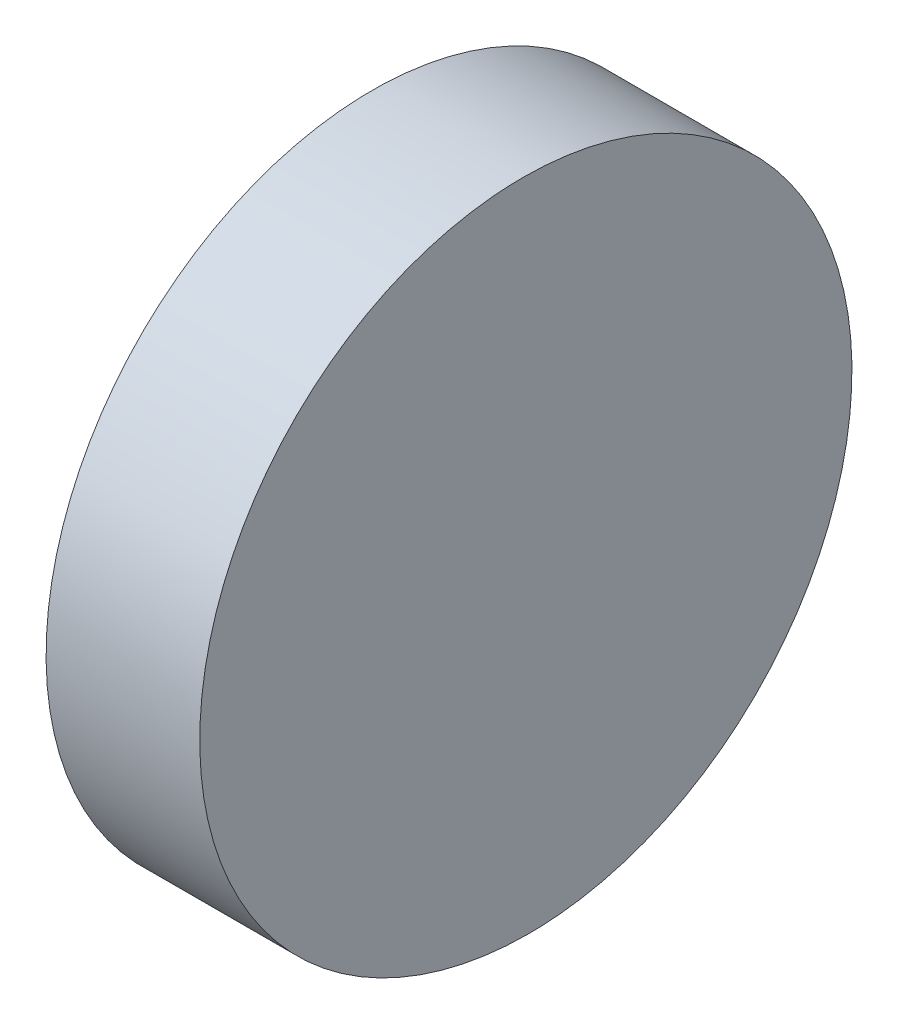
ISO-10303-21;
HEADER;
FILE_DESCRIPTION(('STEP AP214'),'2;1');
FILE_NAME('part.step','',(''),(''),'','','');
FILE_SCHEMA(('AUTOMOTIVE_DESIGN { 1 0 10303 214 1 1 1 1 }'));
ENDSEC;
DATA;
#1=APPLICATION_CONTEXT('core data for automotive mechanical design processes');
#2=APPLICATION_PROTOCOL_DEFINITION('international standard','automotive_design',2000,#1);
#3=PRODUCT_CONTEXT('',#1,'mechanical');
#4=PRODUCT('Part','Part','',(#3));
#5=PRODUCT_RELATED_PRODUCT_CATEGORY('part','',(#4));
#6=PRODUCT_DEFINITION_FORMATION('','',#4);
#7=PRODUCT_DEFINITION_CONTEXT('part definition',#1,'design');
#8=PRODUCT_DEFINITION('design','',#6,#7);
#9=PRODUCT_DEFINITION_SHAPE('','',#8);
#10=(LENGTH_UNIT() NAMED_UNIT(*) SI_UNIT(.MILLI.,.METRE.));
#11=(NAMED_UNIT(*) PLANE_ANGLE_UNIT() SI_UNIT($,.RADIAN.));
#12=(NAMED_UNIT(*) SI_UNIT($,.STERADIAN.) SOLID_ANGLE_UNIT());
#13=UNCERTAINTY_MEASURE_WITH_UNIT(LENGTH_MEASURE(1.E-05),#10,'distance_accuracy_value','');
#14=(GEOMETRIC_REPRESENTATION_CONTEXT(3) GLOBAL_UNCERTAINTY_ASSIGNED_CONTEXT((#13)) GLOBAL_UNIT_ASSIGNED_CONTEXT((#10,
#11,#12)) REPRESENTATION_CONTEXT('',''));
#15=CARTESIAN_POINT('',(0.,0.,0.));
#16=DIRECTION('',(0.,0.,1.));
#17=DIRECTION('',(1.,0.,0.));
#18=AXIS2_PLACEMENT_3D('',#15,#16,#17);
#19=CARTESIAN_POINT('',(0.,6.25,12.5));
#20=DIRECTION('',(1.,0.,0.));
#21=DIRECTION('',(0.,1.,0.));
#22=AXIS2_PLACEMENT_3D('',#19,#20,#21);
#23=PLANE('',#22);
#24=CARTESIAN_POINT('',(0.,0.,6.25));
#25=DIRECTION('',(-1.,0.,0.));
#26=DIRECTION('',(0.,-1.,0.));
#27=AXIS2_PLACEMENT_3D('',#24,#25,#26);
#28=CIRCLE('',#27,6.25);
#29=CARTESIAN_POINT('',(0.,-6.25,6.25));
#30=VERTEX_POINT('',#29);
#31=EDGE_CURVE('E76',#30,#30,#28,.T.);
#32=ORIENTED_EDGE('',*,*,#31,.T.);
#33=EDGE_LOOP('',(#32));
#34=FACE_BOUND('',#33,.T.);
#35=ADVANCED_FACE('F69',(#34),#23,.F.);
#36=CARTESIAN_POINT('',(3.,-6.25,12.5));
#37=DIRECTION('',(-0.999961923064171,-0.00872653549836698,0.));
#38=DIRECTION('',(0.00872653549836698,-0.999961923064171,0.));
#39=AXIS2_PLACEMENT_3D('',#36,#37,#38);
#40=PLANE('',#39);
#41=CARTESIAN_POINT('',(2.9454570763078,0.,6.25));
#42=DIRECTION('',(-0.999961923064171,-0.00872653549836698,0.));
#43=DIRECTION('',(-0.00872653549836698,0.999961923064171,0.));
#44=AXIS2_PLACEMENT_3D('',#41,#42,#43);
#45=ELLIPSE('',#44,6.25023798991086,6.25);
#46=CARTESIAN_POINT('',(2.8909141526156,6.25,6.25));
#47=VERTEX_POINT('',#46);
#48=EDGE_CURVE('E11',#47,#47,#45,.T.);
#49=ORIENTED_EDGE('',*,*,#48,.F.);
#50=EDGE_LOOP('',(#49));
#51=FACE_BOUND('',#50,.T.);
#52=ADVANCED_FACE('F71',(#51),#40,.F.);
#53=CARTESIAN_POINT('',(10.,0.,6.25));
#54=DIRECTION('',(-1.,0.,0.));
#55=DIRECTION('',(0.,-1.,0.));
#56=AXIS2_PLACEMENT_3D('',#53,#54,#55);
#57=CYLINDRICAL_SURFACE('',#56,6.25);
#58=ORIENTED_EDGE('',*,*,#31,.F.);
#59=EDGE_LOOP('',(#58));
#60=FACE_BOUND('',#59,.T.);
#61=ORIENTED_EDGE('',*,*,#48,.T.);
#62=EDGE_LOOP('',(#61));
#63=FACE_BOUND('',#62,.T.);
#64=ADVANCED_FACE('F83',(#60,#63),#57,.T.);
#65=CLOSED_SHELL('',(#35,#52,#64));
#66=MANIFOLD_SOLID_BREP('B2',#65);
#67=ADVANCED_BREP_SHAPE_REPRESENTATION('',(#18,#66),#14);
#68=SHAPE_DEFINITION_REPRESENTATION(#9,#67);
ENDSEC;
END-ISO-10303-21;
